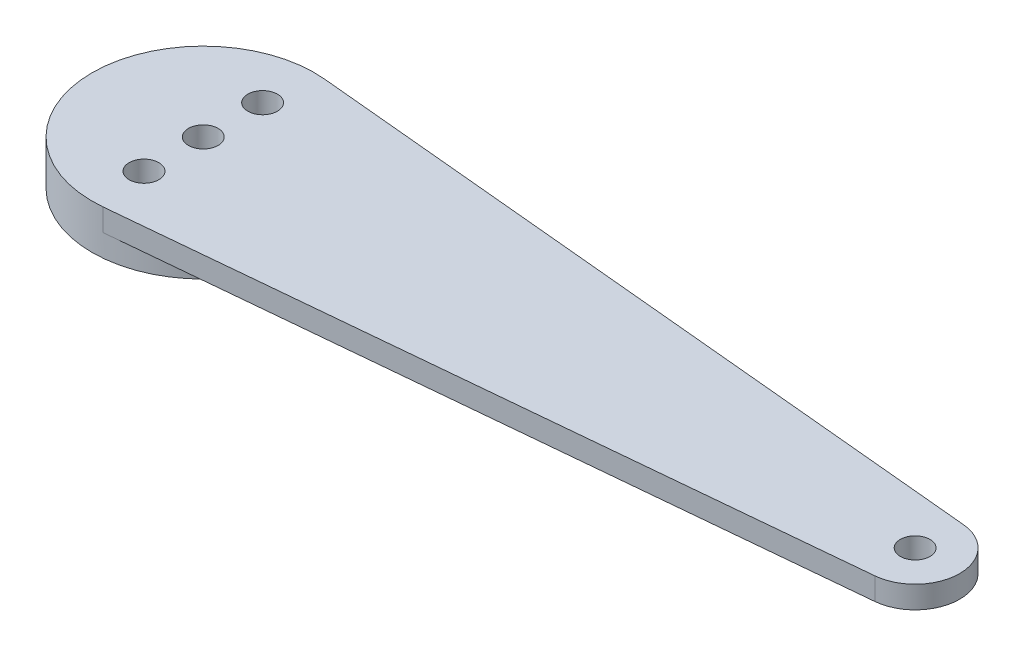
ISO-10303-21;
HEADER;
FILE_DESCRIPTION(('STEP AP214'),'2;1');
FILE_NAME('part.step','',(''),(''),'','','');
FILE_SCHEMA(('AUTOMOTIVE_DESIGN { 1 0 10303 214 1 1 1 1 }'));
ENDSEC;
DATA;
#1=APPLICATION_CONTEXT('core data for automotive mechanical design processes');
#2=APPLICATION_PROTOCOL_DEFINITION('international standard','automotive_design',2000,#1);
#3=PRODUCT_CONTEXT('',#1,'mechanical');
#4=PRODUCT('Part','Part','',(#3));
#5=PRODUCT_RELATED_PRODUCT_CATEGORY('part','',(#4));
#6=PRODUCT_DEFINITION_FORMATION('','',#4);
#7=PRODUCT_DEFINITION_CONTEXT('part definition',#1,'design');
#8=PRODUCT_DEFINITION('design','',#6,#7);
#9=PRODUCT_DEFINITION_SHAPE('','',#8);
#10=(LENGTH_UNIT() NAMED_UNIT(*) SI_UNIT(.MILLI.,.METRE.));
#11=(NAMED_UNIT(*) PLANE_ANGLE_UNIT() SI_UNIT($,.RADIAN.));
#12=(NAMED_UNIT(*) SI_UNIT($,.STERADIAN.) SOLID_ANGLE_UNIT());
#13=UNCERTAINTY_MEASURE_WITH_UNIT(LENGTH_MEASURE(1.E-05),#10,'distance_accuracy_value','');
#14=(GEOMETRIC_REPRESENTATION_CONTEXT(3) GLOBAL_UNCERTAINTY_ASSIGNED_CONTEXT((#13)) GLOBAL_UNIT_ASSIGNED_CONTEXT((#10,
#11,#12)) REPRESENTATION_CONTEXT('',''));
#15=CARTESIAN_POINT('',(0.,0.,0.));
#16=DIRECTION('',(0.,0.,1.));
#17=DIRECTION('',(1.,0.,0.));
#18=AXIS2_PLACEMENT_3D('',#15,#16,#17);
#19=CARTESIAN_POINT('',(0.5625,3.,-5.97357462077775));
#20=DIRECTION('',(-0.09375,0.,0.995595770129624));
#21=DIRECTION('',(0.995595770129625,0.,0.09375));
#22=AXIS2_PLACEMENT_3D('',#19,#20,#21);
#23=PLANE('',#22);
#24=DIRECTION('',(-0.995595770129624,0.,-0.09375));
#25=VECTOR('',#24,1.);
#26=CARTESIAN_POINT('',(0.5625,0.,-5.97357462077775));
#27=LINE('',#26,#25);
#28=CARTESIAN_POINT('',(0.5625,0.,-5.97357462077775));
#29=VERTEX_POINT('',#28);
#30=CARTESIAN_POINT('',(-94.59375,0.,-14.9339365519444));
#31=VERTEX_POINT('',#30);
#32=EDGE_CURVE('E89',#29,#31,#27,.T.);
#33=ORIENTED_EDGE('',*,*,#32,.T.);
#34=DIRECTION('',(0.,-1.,0.));
#35=VECTOR('',#34,1.);
#36=CARTESIAN_POINT('',(-94.59375,3.,-14.9339365519444));
#37=LINE('',#36,#35);
#38=CARTESIAN_POINT('',(-94.59375,3.,-14.9339365519444));
#39=VERTEX_POINT('',#38);
#40=EDGE_CURVE('E11',#39,#31,#37,.T.);
#41=ORIENTED_EDGE('',*,*,#40,.F.);
#42=DIRECTION('',(-0.995595770129624,0.,-0.09375));
#43=VECTOR('',#42,1.);
#44=CARTESIAN_POINT('',(0.5625,3.,-5.97357462077775));
#45=LINE('',#44,#43);
#46=CARTESIAN_POINT('',(0.5625,3.,-5.97357462077775));
#47=VERTEX_POINT('',#46);
#48=EDGE_CURVE('E118',#47,#39,#45,.T.);
#49=ORIENTED_EDGE('',*,*,#48,.F.);
#50=DIRECTION('',(0.,-1.,0.));
#51=VECTOR('',#50,1.);
#52=CARTESIAN_POINT('',(0.5625,3.,-5.97357462077775));
#53=LINE('',#52,#51);
#54=EDGE_CURVE('E56',#47,#29,#53,.T.);
#55=ORIENTED_EDGE('',*,*,#54,.T.);
#56=EDGE_LOOP('',(#33,#41,#49,#55));
#57=FACE_BOUND('',#56,.T.);
#58=ADVANCED_FACE('F39',(#57),#23,.F.);
#59=CARTESIAN_POINT('',(-96.,3.,0.));
#60=DIRECTION('',(0.,-1.,0.));
#61=DIRECTION('',(0.,0.,-1.));
#62=AXIS2_PLACEMENT_3D('',#59,#60,#61);
#63=CYLINDRICAL_SURFACE('',#62,15.);
#64=ORIENTED_EDGE('',*,*,#40,.T.);
#65=CARTESIAN_POINT('',(-96.,0.,0.));
#66=DIRECTION('',(0.,1.,0.));
#67=DIRECTION('',(0.,0.,1.));
#68=AXIS2_PLACEMENT_3D('',#65,#66,#67);
#69=CIRCLE('',#68,15.);
#70=CARTESIAN_POINT('',(-94.59375,0.,14.9339365519444));
#71=VERTEX_POINT('',#70);
#72=EDGE_CURVE('E85',#71,#31,#69,.T.);
#73=ORIENTED_EDGE('',*,*,#72,.F.);
#74=DIRECTION('',(0.,-1.,0.));
#75=VECTOR('',#74,1.);
#76=CARTESIAN_POINT('',(-94.59375,3.,14.9339365519444));
#77=LINE('',#76,#75);
#78=CARTESIAN_POINT('',(-94.59375,3.,14.9339365519444));
#79=VERTEX_POINT('',#78);
#80=EDGE_CURVE('E48',#79,#71,#77,.T.);
#81=ORIENTED_EDGE('',*,*,#80,.F.);
#82=CARTESIAN_POINT('',(-96.,3.,0.));
#83=DIRECTION('',(0.,1.,0.));
#84=DIRECTION('',(0.,0.,1.));
#85=AXIS2_PLACEMENT_3D('',#82,#83,#84);
#86=CIRCLE('',#85,15.);
#87=EDGE_CURVE('E79',#39,#79,#86,.T.);
#88=ORIENTED_EDGE('',*,*,#87,.F.);
#89=EDGE_LOOP('',(#64,#73,#81,#88));
#90=FACE_BOUND('',#89,.T.);
#91=CARTESIAN_POINT('',(-96.,-3.,0.));
#92=DIRECTION('',(0.,1.,0.));
#93=DIRECTION('',(0.,0.,1.));
#94=AXIS2_PLACEMENT_3D('',#91,#92,#93);
#95=CIRCLE('',#94,15.);
#96=CARTESIAN_POINT('',(-96.,-3.,15.));
#97=VERTEX_POINT('',#96);
#98=EDGE_CURVE('E99',#97,#97,#95,.T.);
#99=ORIENTED_EDGE('',*,*,#98,.T.);
#100=EDGE_LOOP('',(#99));
#101=FACE_BOUND('',#100,.T.);
#102=ADVANCED_FACE('F96',(#90,#101),#63,.T.);
#103=CARTESIAN_POINT('',(0.5625,3.,5.97357462077775));
#104=DIRECTION('',(0.09375,0.,0.995595770129624));
#105=DIRECTION('',(0.995595770129625,0.,-0.09375));
#106=AXIS2_PLACEMENT_3D('',#103,#104,#105);
#107=PLANE('',#106);
#108=DIRECTION('',(-0.995595770129624,0.,0.09375));
#109=VECTOR('',#108,1.);
#110=CARTESIAN_POINT('',(0.5625,0.,5.97357462077775));
#111=LINE('',#110,#109);
#112=CARTESIAN_POINT('',(0.5625,0.,5.97357462077775));
#113=VERTEX_POINT('',#112);
#114=EDGE_CURVE('E90',#113,#71,#111,.T.);
#115=ORIENTED_EDGE('',*,*,#114,.F.);
#116=DIRECTION('',(0.,-1.,0.));
#117=VECTOR('',#116,1.);
#118=CARTESIAN_POINT('',(0.5625,3.,5.97357462077775));
#119=LINE('',#118,#117);
#120=CARTESIAN_POINT('',(0.5625,3.,5.97357462077775));
#121=VERTEX_POINT('',#120);
#122=EDGE_CURVE('E68',#121,#113,#119,.T.);
#123=ORIENTED_EDGE('',*,*,#122,.F.);
#124=DIRECTION('',(-0.995595770129624,0.,0.09375));
#125=VECTOR('',#124,1.);
#126=CARTESIAN_POINT('',(0.5625,3.,5.97357462077775));
#127=LINE('',#126,#125);
#128=EDGE_CURVE('E127',#121,#79,#127,.T.);
#129=ORIENTED_EDGE('',*,*,#128,.T.);
#130=ORIENTED_EDGE('',*,*,#80,.T.);
#131=EDGE_LOOP('',(#115,#123,#129,#130));
#132=FACE_BOUND('',#131,.T.);
#133=ADVANCED_FACE('F125',(#132),#107,.T.);
#134=CARTESIAN_POINT('',(-96.,3.,7.99999999999999));
#135=DIRECTION('',(0.,-1.,0.));
#136=DIRECTION('',(0.,0.,-1.));
#137=AXIS2_PLACEMENT_3D('',#134,#135,#136);
#138=CYLINDRICAL_SURFACE('',#137,1.99999999999998);
#139=CARTESIAN_POINT('',(-96.,3.,7.99999999999999));
#140=DIRECTION('',(0.,1.,0.));
#141=DIRECTION('',(0.,0.,1.));
#142=AXIS2_PLACEMENT_3D('',#139,#140,#141);
#143=CIRCLE('',#142,1.99999999999998);
#144=CARTESIAN_POINT('',(-96.,3.,9.99999999999997));
#145=VERTEX_POINT('',#144);
#146=EDGE_CURVE('E146',#145,#145,#143,.T.);
#147=ORIENTED_EDGE('',*,*,#146,.T.);
#148=EDGE_LOOP('',(#147));
#149=FACE_BOUND('',#148,.T.);
#150=CARTESIAN_POINT('',(-96.,-3.,7.99999999999999));
#151=DIRECTION('',(0.,1.,0.));
#152=DIRECTION('',(0.,0.,1.));
#153=AXIS2_PLACEMENT_3D('',#150,#151,#152);
#154=CIRCLE('',#153,1.99999999999998);
#155=CARTESIAN_POINT('',(-96.,-3.,9.99999999999997));
#156=VERTEX_POINT('',#155);
#157=EDGE_CURVE('E197',#156,#156,#154,.T.);
#158=ORIENTED_EDGE('',*,*,#157,.F.);
#159=EDGE_LOOP('',(#158));
#160=FACE_BOUND('',#159,.T.);
#161=ADVANCED_FACE('F178',(#149,#160),#138,.F.);
#162=CARTESIAN_POINT('',(-96.,3.,-8.00000000000001));
#163=DIRECTION('',(0.,-1.,0.));
#164=DIRECTION('',(0.,0.,-1.));
#165=AXIS2_PLACEMENT_3D('',#162,#163,#164);
#166=CYLINDRICAL_SURFACE('',#165,2.);
#167=CARTESIAN_POINT('',(-96.,3.,-8.00000000000001));
#168=DIRECTION('',(0.,1.,0.));
#169=DIRECTION('',(0.,0.,1.));
#170=AXIS2_PLACEMENT_3D('',#167,#168,#169);
#171=CIRCLE('',#170,2.);
#172=CARTESIAN_POINT('',(-96.,3.,-6.00000000000001));
#173=VERTEX_POINT('',#172);
#174=EDGE_CURVE('E143',#173,#173,#171,.T.);
#175=ORIENTED_EDGE('',*,*,#174,.T.);
#176=EDGE_LOOP('',(#175));
#177=FACE_BOUND('',#176,.T.);
#178=CARTESIAN_POINT('',(-96.,-3.,-8.00000000000001));
#179=DIRECTION('',(0.,1.,0.));
#180=DIRECTION('',(0.,0.,1.));
#181=AXIS2_PLACEMENT_3D('',#178,#179,#180);
#182=CIRCLE('',#181,2.);
#183=CARTESIAN_POINT('',(-96.,-3.,-6.00000000000001));
#184=VERTEX_POINT('',#183);
#185=EDGE_CURVE('E93',#184,#184,#182,.T.);
#186=ORIENTED_EDGE('',*,*,#185,.F.);
#187=EDGE_LOOP('',(#186));
#188=FACE_BOUND('',#187,.T.);
#189=ADVANCED_FACE('F186',(#177,#188),#166,.F.);
#190=CARTESIAN_POINT('',(0.,3.,0.));
#191=DIRECTION('',(0.,-1.,0.));
#192=DIRECTION('',(0.,0.,-1.));
#193=AXIS2_PLACEMENT_3D('',#190,#191,#192);
#194=CYLINDRICAL_SURFACE('',#193,2.);
#195=CARTESIAN_POINT('',(0.,3.,0.));
#196=DIRECTION('',(0.,1.,0.));
#197=DIRECTION('',(0.,0.,1.));
#198=AXIS2_PLACEMENT_3D('',#195,#196,#197);
#199=CIRCLE('',#198,2.);
#200=CARTESIAN_POINT('',(0.,3.,2.));
#201=VERTEX_POINT('',#200);
#202=EDGE_CURVE('E135',#201,#201,#199,.T.);
#203=ORIENTED_EDGE('',*,*,#202,.T.);
#204=EDGE_LOOP('',(#203));
#205=FACE_BOUND('',#204,.T.);
#206=CARTESIAN_POINT('',(0.,0.,0.));
#207=DIRECTION('',(0.,1.,0.));
#208=DIRECTION('',(0.,0.,1.));
#209=AXIS2_PLACEMENT_3D('',#206,#207,#208);
#210=CIRCLE('',#209,2.);
#211=CARTESIAN_POINT('',(0.,0.,2.));
#212=VERTEX_POINT('',#211);
#213=EDGE_CURVE('E114',#212,#212,#210,.T.);
#214=ORIENTED_EDGE('',*,*,#213,.F.);
#215=EDGE_LOOP('',(#214));
#216=FACE_BOUND('',#215,.T.);
#217=ADVANCED_FACE('F183',(#205,#216),#194,.F.);
#218=CARTESIAN_POINT('',(0.,3.,0.));
#219=DIRECTION('',(0.,-1.,0.));
#220=DIRECTION('',(0.,0.,-1.));
#221=AXIS2_PLACEMENT_3D('',#218,#219,#220);
#222=CYLINDRICAL_SURFACE('',#221,6.);
#223=CARTESIAN_POINT('',(0.,0.,0.));
#224=DIRECTION('',(0.,1.,0.));
#225=DIRECTION('',(0.,0.,1.));
#226=AXIS2_PLACEMENT_3D('',#223,#224,#225);
#227=CIRCLE('',#226,6.);
#228=EDGE_CURVE('E103',#29,#113,#227,.F.);
#229=ORIENTED_EDGE('',*,*,#228,.F.);
#230=ORIENTED_EDGE('',*,*,#54,.F.);
#231=CARTESIAN_POINT('',(0.,3.,0.));
#232=DIRECTION('',(0.,1.,0.));
#233=DIRECTION('',(0.,0.,1.));
#234=AXIS2_PLACEMENT_3D('',#231,#232,#233);
#235=CIRCLE('',#234,6.);
#236=EDGE_CURVE('E131',#47,#121,#235,.F.);
#237=ORIENTED_EDGE('',*,*,#236,.T.);
#238=ORIENTED_EDGE('',*,*,#122,.T.);
#239=EDGE_LOOP('',(#229,#230,#237,#238));
#240=FACE_BOUND('',#239,.T.);
#241=ADVANCED_FACE('F167',(#240),#222,.T.);
#242=CARTESIAN_POINT('',(-96.,3.,0.));
#243=DIRECTION('',(0.,-1.,0.));
#244=DIRECTION('',(0.,0.,-1.));
#245=AXIS2_PLACEMENT_3D('',#242,#243,#244);
#246=CYLINDRICAL_SURFACE('',#245,2.);
#247=CARTESIAN_POINT('',(-96.,3.,0.));
#248=DIRECTION('',(0.,1.,0.));
#249=DIRECTION('',(0.,0.,1.));
#250=AXIS2_PLACEMENT_3D('',#247,#248,#249);
#251=CIRCLE('',#250,2.);
#252=CARTESIAN_POINT('',(-96.,3.,2.));
#253=VERTEX_POINT('',#252);
#254=EDGE_CURVE('E109',#253,#253,#251,.T.);
#255=ORIENTED_EDGE('',*,*,#254,.T.);
#256=EDGE_LOOP('',(#255));
#257=FACE_BOUND('',#256,.T.);
#258=CARTESIAN_POINT('',(-96.,-3.,0.));
#259=DIRECTION('',(0.,1.,0.));
#260=DIRECTION('',(0.,0.,1.));
#261=AXIS2_PLACEMENT_3D('',#258,#259,#260);
#262=CIRCLE('',#261,2.);
#263=CARTESIAN_POINT('',(-96.,-3.,2.));
#264=VERTEX_POINT('',#263);
#265=EDGE_CURVE('E106',#264,#264,#262,.T.);
#266=ORIENTED_EDGE('',*,*,#265,.F.);
#267=EDGE_LOOP('',(#266));
#268=FACE_BOUND('',#267,.T.);
#269=ADVANCED_FACE('F155',(#257,#268),#246,.F.);
#270=CARTESIAN_POINT('',(0.,3.,0.));
#271=DIRECTION('',(0.,1.,0.));
#272=DIRECTION('',(0.,0.,1.));
#273=AXIS2_PLACEMENT_3D('',#270,#271,#272);
#274=PLANE('',#273);
#275=ORIENTED_EDGE('',*,*,#48,.T.);
#276=ORIENTED_EDGE('',*,*,#87,.T.);
#277=ORIENTED_EDGE('',*,*,#128,.F.);
#278=ORIENTED_EDGE('',*,*,#236,.F.);
#279=EDGE_LOOP('',(#275,#276,#277,#278));
#280=FACE_BOUND('',#279,.T.);
#281=ORIENTED_EDGE('',*,*,#202,.F.);
#282=EDGE_LOOP('',(#281));
#283=FACE_BOUND('',#282,.T.);
#284=ORIENTED_EDGE('',*,*,#174,.F.);
#285=EDGE_LOOP('',(#284));
#286=FACE_BOUND('',#285,.T.);
#287=ORIENTED_EDGE('',*,*,#146,.F.);
#288=EDGE_LOOP('',(#287));
#289=FACE_BOUND('',#288,.T.);
#290=ORIENTED_EDGE('',*,*,#254,.F.);
#291=EDGE_LOOP('',(#290));
#292=FACE_BOUND('',#291,.T.);
#293=ADVANCED_FACE('F158',(#280,#283,#286,#289,#292),#274,.T.);
#294=CARTESIAN_POINT('',(0.,0.,0.));
#295=DIRECTION('',(0.,1.,0.));
#296=DIRECTION('',(0.,0.,1.));
#297=AXIS2_PLACEMENT_3D('',#294,#295,#296);
#298=PLANE('',#297);
#299=ORIENTED_EDGE('',*,*,#114,.T.);
#300=ORIENTED_EDGE('',*,*,#72,.T.);
#301=ORIENTED_EDGE('',*,*,#32,.F.);
#302=ORIENTED_EDGE('',*,*,#228,.T.);
#303=EDGE_LOOP('',(#299,#300,#301,#302));
#304=FACE_BOUND('',#303,.T.);
#305=ORIENTED_EDGE('',*,*,#213,.T.);
#306=EDGE_LOOP('',(#305));
#307=FACE_BOUND('',#306,.T.);
#308=ADVANCED_FACE('F86',(#304,#307),#298,.F.);
#309=CARTESIAN_POINT('',(0.,-3.,0.));
#310=DIRECTION('',(0.,1.,0.));
#311=DIRECTION('',(0.,0.,1.));
#312=AXIS2_PLACEMENT_3D('',#309,#310,#311);
#313=PLANE('',#312);
#314=ORIENTED_EDGE('',*,*,#185,.T.);
#315=EDGE_LOOP('',(#314));
#316=FACE_BOUND('',#315,.T.);
#317=ORIENTED_EDGE('',*,*,#157,.T.);
#318=EDGE_LOOP('',(#317));
#319=FACE_BOUND('',#318,.T.);
#320=ORIENTED_EDGE('',*,*,#265,.T.);
#321=EDGE_LOOP('',(#320));
#322=FACE_BOUND('',#321,.T.);
#323=ORIENTED_EDGE('',*,*,#98,.F.);
#324=EDGE_LOOP('',(#323));
#325=FACE_BOUND('',#324,.T.);
#326=ADVANCED_FACE('F165',(#316,#319,#322,#325),#313,.F.);
#327=CLOSED_SHELL('',(#58,#102,#133,#161,#189,#217,#241,#269,#293,#308,#326));
#328=MANIFOLD_SOLID_BREP('B2',#327);
#329=ADVANCED_BREP_SHAPE_REPRESENTATION('',(#18,#328),#14);
#330=SHAPE_DEFINITION_REPRESENTATION(#9,#329);
ENDSEC;
END-ISO-10303-21;
